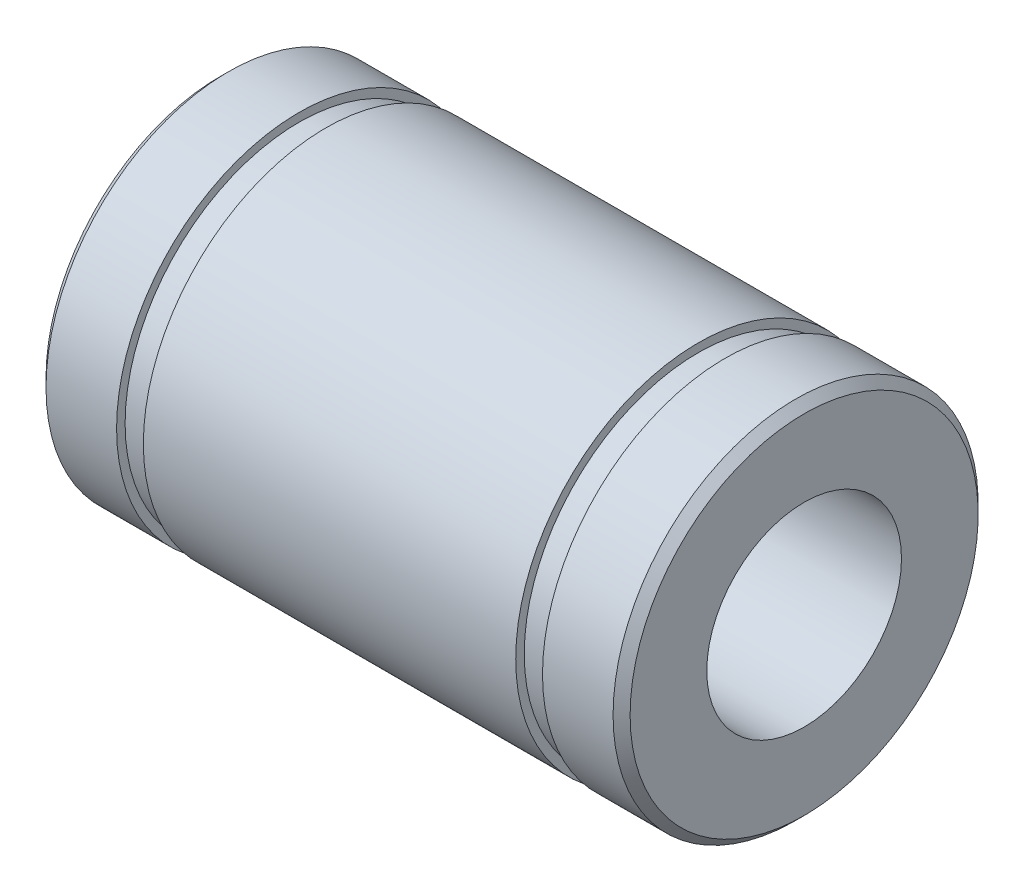
ISO-10303-21;
HEADER;
FILE_DESCRIPTION(('STEP AP214'),'2;1');
FILE_NAME('part.step','',(''),(''),'','','');
FILE_SCHEMA(('AUTOMOTIVE_DESIGN { 1 0 10303 214 1 1 1 1 }'));
ENDSEC;
DATA;
#1=APPLICATION_CONTEXT('core data for automotive mechanical design processes');
#2=APPLICATION_PROTOCOL_DEFINITION('international standard','automotive_design',2000,#1);
#3=PRODUCT_CONTEXT('',#1,'mechanical');
#4=PRODUCT('Part','Part','',(#3));
#5=PRODUCT_RELATED_PRODUCT_CATEGORY('part','',(#4));
#6=PRODUCT_DEFINITION_FORMATION('','',#4);
#7=PRODUCT_DEFINITION_CONTEXT('part definition',#1,'design');
#8=PRODUCT_DEFINITION('design','',#6,#7);
#9=PRODUCT_DEFINITION_SHAPE('','',#8);
#10=(LENGTH_UNIT() NAMED_UNIT(*) SI_UNIT(.MILLI.,.METRE.));
#11=(NAMED_UNIT(*) PLANE_ANGLE_UNIT() SI_UNIT($,.RADIAN.));
#12=(NAMED_UNIT(*) SI_UNIT($,.STERADIAN.) SOLID_ANGLE_UNIT());
#13=UNCERTAINTY_MEASURE_WITH_UNIT(LENGTH_MEASURE(1.E-05),#10,'distance_accuracy_value','');
#14=(GEOMETRIC_REPRESENTATION_CONTEXT(3) GLOBAL_UNCERTAINTY_ASSIGNED_CONTEXT((#13)) GLOBAL_UNIT_ASSIGNED_CONTEXT((#10,
#11,#12)) REPRESENTATION_CONTEXT('',''));
#15=CARTESIAN_POINT('',(0.,0.,0.));
#16=DIRECTION('',(0.,0.,1.));
#17=DIRECTION('',(1.,0.,0.));
#18=AXIS2_PLACEMENT_3D('',#15,#16,#17);
#19=CARTESIAN_POINT('',(11.65,0.,0.));
#20=DIRECTION('',(-1.,0.,0.));
#21=DIRECTION('',(0.,0.,1.));
#22=AXIS2_PLACEMENT_3D('',#19,#20,#21);
#23=CONICAL_SURFACE('',#22,7.5,0.785398163397452);
#24=CARTESIAN_POINT('',(12.,0.,0.));
#25=DIRECTION('',(-1.,0.,0.));
#26=DIRECTION('',(0.,0.,1.));
#27=AXIS2_PLACEMENT_3D('',#24,#25,#26);
#28=CIRCLE('',#27,7.15);
#29=CARTESIAN_POINT('',(12.,0.,7.15));
#30=VERTEX_POINT('',#29);
#31=EDGE_CURVE('E10',#30,#30,#28,.T.);
#32=ORIENTED_EDGE('',*,*,#31,.T.);
#33=EDGE_LOOP('',(#32));
#34=FACE_BOUND('',#33,.T.);
#35=CARTESIAN_POINT('',(11.65,0.,0.));
#36=DIRECTION('',(-1.,0.,0.));
#37=DIRECTION('',(0.,0.,1.));
#38=AXIS2_PLACEMENT_3D('',#35,#36,#37);
#39=CIRCLE('',#38,7.5);
#40=CARTESIAN_POINT('',(11.65,0.,7.5));
#41=VERTEX_POINT('',#40);
#42=EDGE_CURVE('E84',#41,#41,#39,.T.);
#43=ORIENTED_EDGE('',*,*,#42,.F.);
#44=EDGE_LOOP('',(#43));
#45=FACE_BOUND('',#44,.T.);
#46=ADVANCED_FACE('F38',(#34,#45),#23,.T.);
#47=CARTESIAN_POINT('',(12.,0.,7.15));
#48=DIRECTION('',(1.,0.,0.));
#49=DIRECTION('',(0.,0.,-1.));
#50=AXIS2_PLACEMENT_3D('',#47,#48,#49);
#51=PLANE('',#50);
#52=CARTESIAN_POINT('',(12.,0.,0.));
#53=DIRECTION('',(-1.,0.,0.));
#54=DIRECTION('',(0.,0.,1.));
#55=AXIS2_PLACEMENT_3D('',#52,#53,#54);
#56=CIRCLE('',#55,4.);
#57=CARTESIAN_POINT('',(12.,0.,4.));
#58=VERTEX_POINT('',#57);
#59=EDGE_CURVE('E44',#58,#58,#56,.T.);
#60=ORIENTED_EDGE('',*,*,#59,.T.);
#61=EDGE_LOOP('',(#60));
#62=FACE_BOUND('',#61,.T.);
#63=ORIENTED_EDGE('',*,*,#31,.F.);
#64=EDGE_LOOP('',(#63));
#65=FACE_BOUND('',#64,.T.);
#66=ADVANCED_FACE('F92',(#62,#65),#51,.T.);
#67=CARTESIAN_POINT('',(-14.5480382670718,0.,0.));
#68=DIRECTION('',(-1.,0.,0.));
#69=DIRECTION('',(0.,0.,1.));
#70=AXIS2_PLACEMENT_3D('',#67,#68,#69);
#71=CYLINDRICAL_SURFACE('',#70,4.);
#72=CARTESIAN_POINT('',(-12.,0.,0.));
#73=DIRECTION('',(-1.,0.,0.));
#74=DIRECTION('',(0.,0.,1.));
#75=AXIS2_PLACEMENT_3D('',#72,#73,#74);
#76=CIRCLE('',#75,4.);
#77=CARTESIAN_POINT('',(-12.,0.,4.));
#78=VERTEX_POINT('',#77);
#79=EDGE_CURVE('E48',#78,#78,#76,.T.);
#80=ORIENTED_EDGE('',*,*,#79,.T.);
#81=EDGE_LOOP('',(#80));
#82=FACE_BOUND('',#81,.T.);
#83=ORIENTED_EDGE('',*,*,#59,.F.);
#84=EDGE_LOOP('',(#83));
#85=FACE_BOUND('',#84,.T.);
#86=ADVANCED_FACE('F96',(#82,#85),#71,.F.);
#87=CARTESIAN_POINT('',(-12.,0.,7.14999999999999));
#88=DIRECTION('',(-1.,0.,0.));
#89=DIRECTION('',(0.,0.,1.));
#90=AXIS2_PLACEMENT_3D('',#87,#88,#89);
#91=PLANE('',#90);
#92=CARTESIAN_POINT('',(-12.,0.,0.));
#93=DIRECTION('',(-1.,0.,0.));
#94=DIRECTION('',(0.,0.,1.));
#95=AXIS2_PLACEMENT_3D('',#92,#93,#94);
#96=CIRCLE('',#95,7.14999999999999);
#97=CARTESIAN_POINT('',(-12.,0.,7.14999999999999));
#98=VERTEX_POINT('',#97);
#99=EDGE_CURVE('E52',#98,#98,#96,.T.);
#100=ORIENTED_EDGE('',*,*,#99,.T.);
#101=EDGE_LOOP('',(#100));
#102=FACE_BOUND('',#101,.T.);
#103=ORIENTED_EDGE('',*,*,#79,.F.);
#104=EDGE_LOOP('',(#103));
#105=FACE_BOUND('',#104,.T.);
#106=ADVANCED_FACE('F100',(#102,#105),#91,.T.);
#107=CARTESIAN_POINT('',(-12.,0.,0.));
#108=DIRECTION('',(1.,0.,0.));
#109=DIRECTION('',(0.,0.,-1.));
#110=AXIS2_PLACEMENT_3D('',#107,#108,#109);
#111=CONICAL_SURFACE('',#110,7.14999999999999,0.785398163397435);
#112=CARTESIAN_POINT('',(-11.65,0.,0.));
#113=DIRECTION('',(-1.,0.,0.));
#114=DIRECTION('',(0.,0.,1.));
#115=AXIS2_PLACEMENT_3D('',#112,#113,#114);
#116=CIRCLE('',#115,7.5);
#117=CARTESIAN_POINT('',(-11.65,0.,7.5));
#118=VERTEX_POINT('',#117);
#119=EDGE_CURVE('E57',#118,#118,#116,.T.);
#120=ORIENTED_EDGE('',*,*,#119,.T.);
#121=EDGE_LOOP('',(#120));
#122=FACE_BOUND('',#121,.T.);
#123=ORIENTED_EDGE('',*,*,#99,.F.);
#124=EDGE_LOOP('',(#123));
#125=FACE_BOUND('',#124,.T.);
#126=ADVANCED_FACE('F107',(#122,#125),#111,.T.);
#127=CARTESIAN_POINT('',(-14.5480382670718,0.,0.));
#128=DIRECTION('',(-1.,0.,0.));
#129=DIRECTION('',(0.,0.,1.));
#130=AXIS2_PLACEMENT_3D('',#127,#128,#129);
#131=CYLINDRICAL_SURFACE('',#130,7.5);
#132=CARTESIAN_POINT('',(-8.75,0.,0.));
#133=DIRECTION('',(-1.,0.,0.));
#134=DIRECTION('',(0.,0.,1.));
#135=AXIS2_PLACEMENT_3D('',#132,#133,#134);
#136=CIRCLE('',#135,7.5);
#137=CARTESIAN_POINT('',(-8.75,0.,7.5));
#138=VERTEX_POINT('',#137);
#139=EDGE_CURVE('E60',#138,#138,#136,.T.);
#140=ORIENTED_EDGE('',*,*,#139,.T.);
#141=EDGE_LOOP('',(#140));
#142=FACE_BOUND('',#141,.T.);
#143=ORIENTED_EDGE('',*,*,#119,.F.);
#144=EDGE_LOOP('',(#143));
#145=FACE_BOUND('',#144,.T.);
#146=ADVANCED_FACE('F111',(#142,#145),#131,.T.);
#147=CARTESIAN_POINT('',(-8.75,0.,7.14999999999999));
#148=DIRECTION('',(1.,0.,0.));
#149=DIRECTION('',(0.,0.,-1.));
#150=AXIS2_PLACEMENT_3D('',#147,#148,#149);
#151=PLANE('',#150);
#152=CARTESIAN_POINT('',(-8.75,0.,0.));
#153=DIRECTION('',(-1.,0.,0.));
#154=DIRECTION('',(0.,0.,1.));
#155=AXIS2_PLACEMENT_3D('',#152,#153,#154);
#156=CIRCLE('',#155,7.14999999999999);
#157=CARTESIAN_POINT('',(-8.75,0.,7.14999999999999));
#158=VERTEX_POINT('',#157);
#159=EDGE_CURVE('E63',#158,#158,#156,.T.);
#160=ORIENTED_EDGE('',*,*,#159,.T.);
#161=EDGE_LOOP('',(#160));
#162=FACE_BOUND('',#161,.T.);
#163=ORIENTED_EDGE('',*,*,#139,.F.);
#164=EDGE_LOOP('',(#163));
#165=FACE_BOUND('',#164,.T.);
#166=ADVANCED_FACE('F115',(#162,#165),#151,.T.);
#167=CARTESIAN_POINT('',(-14.5480382670718,0.,0.));
#168=DIRECTION('',(-1.,0.,0.));
#169=DIRECTION('',(0.,0.,1.));
#170=AXIS2_PLACEMENT_3D('',#167,#168,#169);
#171=CYLINDRICAL_SURFACE('',#170,7.14999999999999);
#172=CARTESIAN_POINT('',(-7.64999999999996,0.,0.));
#173=DIRECTION('',(-1.,0.,0.));
#174=DIRECTION('',(0.,0.,1.));
#175=AXIS2_PLACEMENT_3D('',#172,#173,#174);
#176=CIRCLE('',#175,7.14999999999999);
#177=CARTESIAN_POINT('',(-7.64999999999996,0.,7.14999999999999));
#178=VERTEX_POINT('',#177);
#179=EDGE_CURVE('E66',#178,#178,#176,.T.);
#180=ORIENTED_EDGE('',*,*,#179,.T.);
#181=EDGE_LOOP('',(#180));
#182=FACE_BOUND('',#181,.T.);
#183=ORIENTED_EDGE('',*,*,#159,.F.);
#184=EDGE_LOOP('',(#183));
#185=FACE_BOUND('',#184,.T.);
#186=ADVANCED_FACE('F119',(#182,#185),#171,.T.);
#187=CARTESIAN_POINT('',(-7.64999999999998,0.,7.14999999999999));
#188=DIRECTION('',(-1.,0.,0.));
#189=DIRECTION('',(0.,0.,1.));
#190=AXIS2_PLACEMENT_3D('',#187,#188,#189);
#191=PLANE('',#190);
#192=CARTESIAN_POINT('',(-7.65,0.,0.));
#193=DIRECTION('',(-1.,0.,0.));
#194=DIRECTION('',(0.,0.,1.));
#195=AXIS2_PLACEMENT_3D('',#192,#193,#194);
#196=CIRCLE('',#195,7.5);
#197=CARTESIAN_POINT('',(-7.65,0.,7.5));
#198=VERTEX_POINT('',#197);
#199=EDGE_CURVE('E69',#198,#198,#196,.T.);
#200=ORIENTED_EDGE('',*,*,#199,.T.);
#201=EDGE_LOOP('',(#200));
#202=FACE_BOUND('',#201,.T.);
#203=ORIENTED_EDGE('',*,*,#179,.F.);
#204=EDGE_LOOP('',(#203));
#205=FACE_BOUND('',#204,.T.);
#206=ADVANCED_FACE('F123',(#202,#205),#191,.T.);
#207=CARTESIAN_POINT('',(-14.5480382670718,0.,0.));
#208=DIRECTION('',(-1.,0.,0.));
#209=DIRECTION('',(0.,0.,1.));
#210=AXIS2_PLACEMENT_3D('',#207,#208,#209);
#211=CYLINDRICAL_SURFACE('',#210,7.5);
#212=CARTESIAN_POINT('',(7.65,0.,0.));
#213=DIRECTION('',(-1.,0.,0.));
#214=DIRECTION('',(0.,0.,1.));
#215=AXIS2_PLACEMENT_3D('',#212,#213,#214);
#216=CIRCLE('',#215,7.5);
#217=CARTESIAN_POINT('',(7.65,0.,7.5));
#218=VERTEX_POINT('',#217);
#219=EDGE_CURVE('E72',#218,#218,#216,.T.);
#220=ORIENTED_EDGE('',*,*,#219,.T.);
#221=EDGE_LOOP('',(#220));
#222=FACE_BOUND('',#221,.T.);
#223=ORIENTED_EDGE('',*,*,#199,.F.);
#224=EDGE_LOOP('',(#223));
#225=FACE_BOUND('',#224,.T.);
#226=ADVANCED_FACE('F127',(#222,#225),#211,.T.);
#227=CARTESIAN_POINT('',(7.65,0.,7.15));
#228=DIRECTION('',(1.,0.,0.));
#229=DIRECTION('',(0.,0.,-1.));
#230=AXIS2_PLACEMENT_3D('',#227,#228,#229);
#231=PLANE('',#230);
#232=CARTESIAN_POINT('',(7.65,0.,0.));
#233=DIRECTION('',(-1.,0.,0.));
#234=DIRECTION('',(0.,0.,1.));
#235=AXIS2_PLACEMENT_3D('',#232,#233,#234);
#236=CIRCLE('',#235,7.15);
#237=CARTESIAN_POINT('',(7.65,0.,7.15));
#238=VERTEX_POINT('',#237);
#239=EDGE_CURVE('E75',#238,#238,#236,.T.);
#240=ORIENTED_EDGE('',*,*,#239,.T.);
#241=EDGE_LOOP('',(#240));
#242=FACE_BOUND('',#241,.T.);
#243=ORIENTED_EDGE('',*,*,#219,.F.);
#244=EDGE_LOOP('',(#243));
#245=FACE_BOUND('',#244,.T.);
#246=ADVANCED_FACE('F131',(#242,#245),#231,.T.);
#247=CARTESIAN_POINT('',(-14.5480382670718,0.,0.));
#248=DIRECTION('',(-1.,0.,0.));
#249=DIRECTION('',(0.,0.,1.));
#250=AXIS2_PLACEMENT_3D('',#247,#248,#249);
#251=CYLINDRICAL_SURFACE('',#250,7.15);
#252=CARTESIAN_POINT('',(8.75,0.,0.));
#253=DIRECTION('',(-1.,0.,0.));
#254=DIRECTION('',(0.,0.,1.));
#255=AXIS2_PLACEMENT_3D('',#252,#253,#254);
#256=CIRCLE('',#255,7.15);
#257=CARTESIAN_POINT('',(8.75,0.,7.15));
#258=VERTEX_POINT('',#257);
#259=EDGE_CURVE('E78',#258,#258,#256,.T.);
#260=ORIENTED_EDGE('',*,*,#259,.T.);
#261=EDGE_LOOP('',(#260));
#262=FACE_BOUND('',#261,.T.);
#263=ORIENTED_EDGE('',*,*,#239,.F.);
#264=EDGE_LOOP('',(#263));
#265=FACE_BOUND('',#264,.T.);
#266=ADVANCED_FACE('F135',(#262,#265),#251,.T.);
#267=CARTESIAN_POINT('',(8.75,0.,7.5));
#268=DIRECTION('',(-1.,0.,0.));
#269=DIRECTION('',(0.,0.,1.));
#270=AXIS2_PLACEMENT_3D('',#267,#268,#269);
#271=PLANE('',#270);
#272=CARTESIAN_POINT('',(8.75,0.,0.));
#273=DIRECTION('',(-1.,0.,0.));
#274=DIRECTION('',(0.,0.,1.));
#275=AXIS2_PLACEMENT_3D('',#272,#273,#274);
#276=CIRCLE('',#275,7.5);
#277=CARTESIAN_POINT('',(8.75,0.,7.5));
#278=VERTEX_POINT('',#277);
#279=EDGE_CURVE('E81',#278,#278,#276,.T.);
#280=ORIENTED_EDGE('',*,*,#279,.T.);
#281=EDGE_LOOP('',(#280));
#282=FACE_BOUND('',#281,.T.);
#283=ORIENTED_EDGE('',*,*,#259,.F.);
#284=EDGE_LOOP('',(#283));
#285=FACE_BOUND('',#284,.T.);
#286=ADVANCED_FACE('F139',(#282,#285),#271,.T.);
#287=CARTESIAN_POINT('',(-14.5480382670718,0.,0.));
#288=DIRECTION('',(-1.,0.,0.));
#289=DIRECTION('',(0.,0.,1.));
#290=AXIS2_PLACEMENT_3D('',#287,#288,#289);
#291=CYLINDRICAL_SURFACE('',#290,7.5);
#292=ORIENTED_EDGE('',*,*,#42,.T.);
#293=EDGE_LOOP('',(#292));
#294=FACE_BOUND('',#293,.T.);
#295=ORIENTED_EDGE('',*,*,#279,.F.);
#296=EDGE_LOOP('',(#295));
#297=FACE_BOUND('',#296,.T.);
#298=ADVANCED_FACE('F88',(#294,#297),#291,.T.);
#299=CLOSED_SHELL('',(#46,#66,#86,#106,#126,#146,#166,#186,#206,#226,#246,#266,#286,#298));
#300=MANIFOLD_SOLID_BREP('B2',#299);
#301=ADVANCED_BREP_SHAPE_REPRESENTATION('',(#18,#300),#14);
#302=SHAPE_DEFINITION_REPRESENTATION(#9,#301);
ENDSEC;
END-ISO-10303-21;
